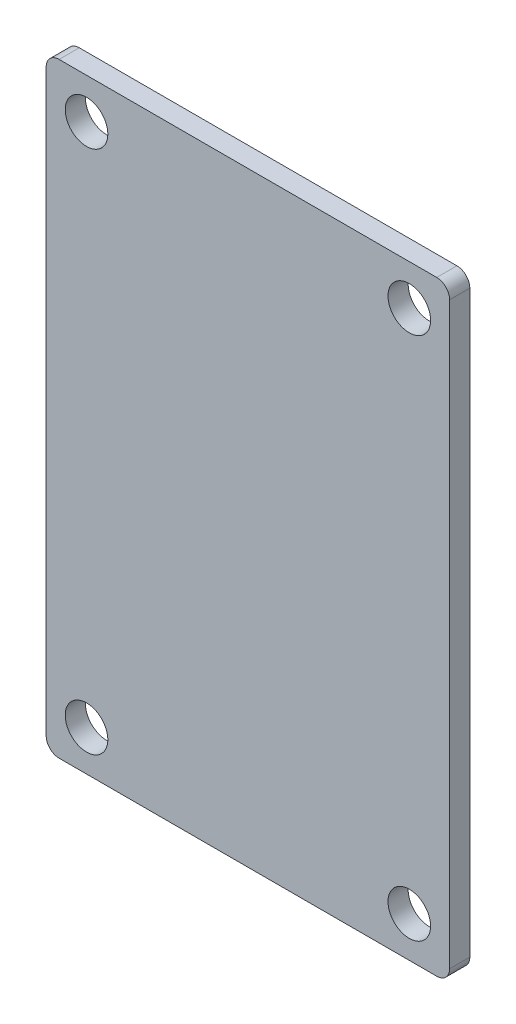
ISO-10303-21;
HEADER;
FILE_DESCRIPTION(('STEP AP214'),'2;1');
FILE_NAME('part.step','',(''),(''),'','','');
FILE_SCHEMA(('AUTOMOTIVE_DESIGN { 1 0 10303 214 1 1 1 1 }'));
ENDSEC;
DATA;
#1=APPLICATION_CONTEXT('core data for automotive mechanical design processes');
#2=APPLICATION_PROTOCOL_DEFINITION('international standard','automotive_design',2000,#1);
#3=PRODUCT_CONTEXT('',#1,'mechanical');
#4=PRODUCT('Part','Part','',(#3));
#5=PRODUCT_RELATED_PRODUCT_CATEGORY('part','',(#4));
#6=PRODUCT_DEFINITION_FORMATION('','',#4);
#7=PRODUCT_DEFINITION_CONTEXT('part definition',#1,'design');
#8=PRODUCT_DEFINITION('design','',#6,#7);
#9=PRODUCT_DEFINITION_SHAPE('','',#8);
#10=(LENGTH_UNIT() NAMED_UNIT(*) SI_UNIT(.MILLI.,.METRE.));
#11=(NAMED_UNIT(*) PLANE_ANGLE_UNIT() SI_UNIT($,.RADIAN.));
#12=(NAMED_UNIT(*) SI_UNIT($,.STERADIAN.) SOLID_ANGLE_UNIT());
#13=UNCERTAINTY_MEASURE_WITH_UNIT(LENGTH_MEASURE(1.E-05),#10,'distance_accuracy_value','');
#14=(GEOMETRIC_REPRESENTATION_CONTEXT(3) GLOBAL_UNCERTAINTY_ASSIGNED_CONTEXT((#13)) GLOBAL_UNIT_ASSIGNED_CONTEXT((#10,
#11,#12)) REPRESENTATION_CONTEXT('',''));
#15=CARTESIAN_POINT('',(0.,0.,0.));
#16=DIRECTION('',(0.,0.,1.));
#17=DIRECTION('',(1.,0.,0.));
#18=AXIS2_PLACEMENT_3D('',#15,#16,#17);
#19=CARTESIAN_POINT('',(0.,0.,3.175));
#20=DIRECTION('',(0.,0.,-1.));
#21=DIRECTION('',(-1.,0.,0.));
#22=AXIS2_PLACEMENT_3D('',#19,#20,#21);
#23=PLANE('',#22);
#24=CARTESIAN_POINT('',(-29.718,45.593,3.175));
#25=DIRECTION('',(0.,0.,-1.));
#26=DIRECTION('',(-1.,0.,0.));
#27=AXIS2_PLACEMENT_3D('',#24,#25,#26);
#28=CIRCLE('',#27,2.032);
#29=CARTESIAN_POINT('',(-31.75,45.593,3.175));
#30=VERTEX_POINT('',#29);
#31=CARTESIAN_POINT('',(-29.718,47.625,3.175));
#32=VERTEX_POINT('',#31);
#33=EDGE_CURVE('E80',#30,#32,#28,.T.);
#34=ORIENTED_EDGE('',*,*,#33,.F.);
#35=DIRECTION('',(0.,1.,0.));
#36=VECTOR('',#35,1.);
#37=CARTESIAN_POINT('',(-31.75,-47.625,3.175));
#38=LINE('',#37,#36);
#39=CARTESIAN_POINT('',(-31.75,-45.593,3.175));
#40=VERTEX_POINT('',#39);
#41=EDGE_CURVE('E98',#30,#40,#38,.F.);
#42=ORIENTED_EDGE('',*,*,#41,.T.);
#43=CARTESIAN_POINT('',(-29.718,-45.593,3.175));
#44=DIRECTION('',(0.,0.,-1.));
#45=DIRECTION('',(-1.,0.,0.));
#46=AXIS2_PLACEMENT_3D('',#43,#44,#45);
#47=CIRCLE('',#46,2.032);
#48=CARTESIAN_POINT('',(-29.718,-47.625,3.175));
#49=VERTEX_POINT('',#48);
#50=EDGE_CURVE('E142',#49,#40,#47,.T.);
#51=ORIENTED_EDGE('',*,*,#50,.F.);
#52=DIRECTION('',(1.,0.,0.));
#53=VECTOR('',#52,1.);
#54=CARTESIAN_POINT('',(-31.75,-47.625,3.175));
#55=LINE('',#54,#53);
#56=CARTESIAN_POINT('',(29.718,-47.625,3.175));
#57=VERTEX_POINT('',#56);
#58=EDGE_CURVE('E111',#49,#57,#55,.T.);
#59=ORIENTED_EDGE('',*,*,#58,.T.);
#60=CARTESIAN_POINT('',(29.718,-45.593,3.175));
#61=DIRECTION('',(0.,0.,-1.));
#62=DIRECTION('',(-1.,0.,0.));
#63=AXIS2_PLACEMENT_3D('',#60,#61,#62);
#64=CIRCLE('',#63,2.032);
#65=CARTESIAN_POINT('',(31.75,-45.593,3.175));
#66=VERTEX_POINT('',#65);
#67=EDGE_CURVE('E146',#66,#57,#64,.T.);
#68=ORIENTED_EDGE('',*,*,#67,.F.);
#69=DIRECTION('',(0.,1.,0.));
#70=VECTOR('',#69,1.);
#71=CARTESIAN_POINT('',(31.75,-47.625,3.175));
#72=LINE('',#71,#70);
#73=CARTESIAN_POINT('',(31.75,45.593,3.175));
#74=VERTEX_POINT('',#73);
#75=EDGE_CURVE('E117',#66,#74,#72,.T.);
#76=ORIENTED_EDGE('',*,*,#75,.T.);
#77=CARTESIAN_POINT('',(29.718,45.593,3.175));
#78=DIRECTION('',(0.,0.,-1.));
#79=DIRECTION('',(-1.,0.,0.));
#80=AXIS2_PLACEMENT_3D('',#77,#78,#79);
#81=CIRCLE('',#80,2.032);
#82=CARTESIAN_POINT('',(29.718,47.625,3.175));
#83=VERTEX_POINT('',#82);
#84=EDGE_CURVE('E86',#83,#74,#81,.T.);
#85=ORIENTED_EDGE('',*,*,#84,.F.);
#86=DIRECTION('',(1.,0.,0.));
#87=VECTOR('',#86,1.);
#88=CARTESIAN_POINT('',(-31.75,47.625,3.175));
#89=LINE('',#88,#87);
#90=EDGE_CURVE('E83',#83,#32,#89,.F.);
#91=ORIENTED_EDGE('',*,*,#90,.T.);
#92=EDGE_LOOP('',(#34,#42,#51,#59,#68,#76,#85,#91));
#93=FACE_BOUND('',#92,.T.);
#94=CARTESIAN_POINT('',(-25.4,41.275,3.175));
#95=DIRECTION('',(0.,0.,1.));
#96=DIRECTION('',(1.,0.,0.));
#97=AXIS2_PLACEMENT_3D('',#94,#95,#96);
#98=CIRCLE('',#97,3.3528);
#99=CARTESIAN_POINT('',(-22.0472,41.275,3.175));
#100=VERTEX_POINT('',#99);
#101=EDGE_CURVE('E116',#100,#100,#98,.F.);
#102=ORIENTED_EDGE('',*,*,#101,.T.);
#103=EDGE_LOOP('',(#102));
#104=FACE_BOUND('',#103,.T.);
#105=CARTESIAN_POINT('',(-25.4,-41.275,3.175));
#106=DIRECTION('',(0.,0.,1.));
#107=DIRECTION('',(1.,0.,0.));
#108=AXIS2_PLACEMENT_3D('',#105,#106,#107);
#109=CIRCLE('',#108,3.3528);
#110=CARTESIAN_POINT('',(-22.0472,-41.275,3.175));
#111=VERTEX_POINT('',#110);
#112=EDGE_CURVE('E151',#111,#111,#109,.F.);
#113=ORIENTED_EDGE('',*,*,#112,.T.);
#114=EDGE_LOOP('',(#113));
#115=FACE_BOUND('',#114,.T.);
#116=CARTESIAN_POINT('',(25.4,41.275,3.175));
#117=DIRECTION('',(0.,0.,1.));
#118=DIRECTION('',(1.,0.,0.));
#119=AXIS2_PLACEMENT_3D('',#116,#117,#118);
#120=CIRCLE('',#119,3.3528);
#121=CARTESIAN_POINT('',(28.7528,41.275,3.175));
#122=VERTEX_POINT('',#121);
#123=EDGE_CURVE('E153',#122,#122,#120,.F.);
#124=ORIENTED_EDGE('',*,*,#123,.T.);
#125=EDGE_LOOP('',(#124));
#126=FACE_BOUND('',#125,.T.);
#127=CARTESIAN_POINT('',(25.4,-41.275,3.175));
#128=DIRECTION('',(0.,0.,1.));
#129=DIRECTION('',(1.,0.,0.));
#130=AXIS2_PLACEMENT_3D('',#127,#128,#129);
#131=CIRCLE('',#130,3.3528);
#132=CARTESIAN_POINT('',(28.7528,-41.275,3.175));
#133=VERTEX_POINT('',#132);
#134=EDGE_CURVE('E20',#133,#133,#131,.F.);
#135=ORIENTED_EDGE('',*,*,#134,.T.);
#136=EDGE_LOOP('',(#135));
#137=FACE_BOUND('',#136,.T.);
#138=ADVANCED_FACE('F17',(#93,#104,#115,#126,#137),#23,.F.);
#139=CARTESIAN_POINT('',(25.4,-41.275,0.));
#140=DIRECTION('',(0.,0.,1.));
#141=DIRECTION('',(1.,0.,0.));
#142=AXIS2_PLACEMENT_3D('',#139,#140,#141);
#143=CYLINDRICAL_SURFACE('',#142,3.3528);
#144=ORIENTED_EDGE('',*,*,#134,.F.);
#145=EDGE_LOOP('',(#144));
#146=FACE_BOUND('',#145,.T.);
#147=CARTESIAN_POINT('',(25.4,-41.275,0.));
#148=DIRECTION('',(0.,0.,1.));
#149=DIRECTION('',(1.,0.,0.));
#150=AXIS2_PLACEMENT_3D('',#147,#148,#149);
#151=CIRCLE('',#150,3.3528);
#152=CARTESIAN_POINT('',(28.7528,-41.275,0.));
#153=VERTEX_POINT('',#152);
#154=EDGE_CURVE('E139',#153,#153,#151,.T.);
#155=ORIENTED_EDGE('',*,*,#154,.F.);
#156=EDGE_LOOP('',(#155));
#157=FACE_BOUND('',#156,.T.);
#158=ADVANCED_FACE('F161',(#146,#157),#143,.F.);
#159=CARTESIAN_POINT('',(25.4,41.275,0.));
#160=DIRECTION('',(0.,0.,1.));
#161=DIRECTION('',(1.,0.,0.));
#162=AXIS2_PLACEMENT_3D('',#159,#160,#161);
#163=CYLINDRICAL_SURFACE('',#162,3.3528);
#164=ORIENTED_EDGE('',*,*,#123,.F.);
#165=EDGE_LOOP('',(#164));
#166=FACE_BOUND('',#165,.T.);
#167=CARTESIAN_POINT('',(25.4,41.275,0.));
#168=DIRECTION('',(0.,0.,1.));
#169=DIRECTION('',(1.,0.,0.));
#170=AXIS2_PLACEMENT_3D('',#167,#168,#169);
#171=CIRCLE('',#170,3.3528);
#172=CARTESIAN_POINT('',(28.7528,41.275,0.));
#173=VERTEX_POINT('',#172);
#174=EDGE_CURVE('E136',#173,#173,#171,.T.);
#175=ORIENTED_EDGE('',*,*,#174,.F.);
#176=EDGE_LOOP('',(#175));
#177=FACE_BOUND('',#176,.T.);
#178=ADVANCED_FACE('F164',(#166,#177),#163,.F.);
#179=CARTESIAN_POINT('',(-25.4,-41.275,0.));
#180=DIRECTION('',(0.,0.,1.));
#181=DIRECTION('',(1.,0.,0.));
#182=AXIS2_PLACEMENT_3D('',#179,#180,#181);
#183=CYLINDRICAL_SURFACE('',#182,3.3528);
#184=ORIENTED_EDGE('',*,*,#112,.F.);
#185=EDGE_LOOP('',(#184));
#186=FACE_BOUND('',#185,.T.);
#187=CARTESIAN_POINT('',(-25.4,-41.275,0.));
#188=DIRECTION('',(0.,0.,1.));
#189=DIRECTION('',(1.,0.,0.));
#190=AXIS2_PLACEMENT_3D('',#187,#188,#189);
#191=CIRCLE('',#190,3.3528);
#192=CARTESIAN_POINT('',(-22.0472,-41.275,0.));
#193=VERTEX_POINT('',#192);
#194=EDGE_CURVE('E133',#193,#193,#191,.T.);
#195=ORIENTED_EDGE('',*,*,#194,.F.);
#196=EDGE_LOOP('',(#195));
#197=FACE_BOUND('',#196,.T.);
#198=ADVANCED_FACE('F207',(#186,#197),#183,.F.);
#199=CARTESIAN_POINT('',(-25.4,41.275,0.));
#200=DIRECTION('',(0.,0.,1.));
#201=DIRECTION('',(1.,0.,0.));
#202=AXIS2_PLACEMENT_3D('',#199,#200,#201);
#203=CYLINDRICAL_SURFACE('',#202,3.3528);
#204=ORIENTED_EDGE('',*,*,#101,.F.);
#205=EDGE_LOOP('',(#204));
#206=FACE_BOUND('',#205,.T.);
#207=CARTESIAN_POINT('',(-25.4,41.275,0.));
#208=DIRECTION('',(0.,0.,1.));
#209=DIRECTION('',(1.,0.,0.));
#210=AXIS2_PLACEMENT_3D('',#207,#208,#209);
#211=CIRCLE('',#210,3.3528);
#212=CARTESIAN_POINT('',(-22.0472,41.275,0.));
#213=VERTEX_POINT('',#212);
#214=EDGE_CURVE('E130',#213,#213,#211,.T.);
#215=ORIENTED_EDGE('',*,*,#214,.F.);
#216=EDGE_LOOP('',(#215));
#217=FACE_BOUND('',#216,.T.);
#218=ADVANCED_FACE('F203',(#206,#217),#203,.F.);
#219=CARTESIAN_POINT('',(-31.75,-47.625,3.175));
#220=DIRECTION('',(1.,0.,0.));
#221=DIRECTION('',(0.,0.,-1.));
#222=AXIS2_PLACEMENT_3D('',#219,#220,#221);
#223=PLANE('',#222);
#224=DIRECTION('',(0.,0.,-1.));
#225=VECTOR('',#224,1.);
#226=CARTESIAN_POINT('',(-31.75,45.593,3.175));
#227=LINE('',#226,#225);
#228=CARTESIAN_POINT('',(-31.75,45.593,0.));
#229=VERTEX_POINT('',#228);
#230=EDGE_CURVE('E91',#229,#30,#227,.F.);
#231=ORIENTED_EDGE('',*,*,#230,.F.);
#232=DIRECTION('',(0.,1.,0.));
#233=VECTOR('',#232,1.);
#234=CARTESIAN_POINT('',(-31.75,0.,0.));
#235=LINE('',#234,#233);
#236=CARTESIAN_POINT('',(-31.75,-45.593,0.));
#237=VERTEX_POINT('',#236);
#238=EDGE_CURVE('E129',#237,#229,#235,.T.);
#239=ORIENTED_EDGE('',*,*,#238,.F.);
#240=DIRECTION('',(0.,0.,-1.));
#241=VECTOR('',#240,1.);
#242=CARTESIAN_POINT('',(-31.75,-45.593,3.175));
#243=LINE('',#242,#241);
#244=EDGE_CURVE('E145',#40,#237,#243,.T.);
#245=ORIENTED_EDGE('',*,*,#244,.F.);
#246=ORIENTED_EDGE('',*,*,#41,.F.);
#247=EDGE_LOOP('',(#231,#239,#245,#246));
#248=FACE_BOUND('',#247,.T.);
#249=ADVANCED_FACE('F200',(#248),#223,.F.);
#250=CARTESIAN_POINT('',(-29.718,45.593,3.175));
#251=DIRECTION('',(0.,0.,-1.));
#252=DIRECTION('',(-1.,0.,0.));
#253=AXIS2_PLACEMENT_3D('',#250,#251,#252);
#254=CYLINDRICAL_SURFACE('',#253,2.032);
#255=CARTESIAN_POINT('',(-29.718,45.593,0.));
#256=DIRECTION('',(0.,0.,-1.));
#257=DIRECTION('',(-1.,0.,0.));
#258=AXIS2_PLACEMENT_3D('',#255,#256,#257);
#259=CIRCLE('',#258,2.032);
#260=CARTESIAN_POINT('',(-29.718,47.625,0.));
#261=VERTEX_POINT('',#260);
#262=EDGE_CURVE('E127',#229,#261,#259,.T.);
#263=ORIENTED_EDGE('',*,*,#262,.F.);
#264=ORIENTED_EDGE('',*,*,#230,.T.);
#265=ORIENTED_EDGE('',*,*,#33,.T.);
#266=DIRECTION('',(0.,0.,-1.));
#267=VECTOR('',#266,1.);
#268=CARTESIAN_POINT('',(-29.718,47.625,3.175));
#269=LINE('',#268,#267);
#270=EDGE_CURVE('E90',#32,#261,#269,.T.);
#271=ORIENTED_EDGE('',*,*,#270,.T.);
#272=EDGE_LOOP('',(#263,#264,#265,#271));
#273=FACE_BOUND('',#272,.T.);
#274=ADVANCED_FACE('F96',(#273),#254,.T.);
#275=CARTESIAN_POINT('',(-31.75,47.625,3.175));
#276=DIRECTION('',(0.,-1.,0.));
#277=DIRECTION('',(0.,0.,-1.));
#278=AXIS2_PLACEMENT_3D('',#275,#276,#277);
#279=PLANE('',#278);
#280=ORIENTED_EDGE('',*,*,#270,.F.);
#281=ORIENTED_EDGE('',*,*,#90,.F.);
#282=DIRECTION('',(0.,0.,-1.));
#283=VECTOR('',#282,1.);
#284=CARTESIAN_POINT('',(29.718,47.625,3.175));
#285=LINE('',#284,#283);
#286=CARTESIAN_POINT('',(29.718,47.625,0.));
#287=VERTEX_POINT('',#286);
#288=EDGE_CURVE('E105',#287,#83,#285,.F.);
#289=ORIENTED_EDGE('',*,*,#288,.F.);
#290=DIRECTION('',(-1.,0.,0.));
#291=VECTOR('',#290,1.);
#292=CARTESIAN_POINT('',(0.,47.625,0.));
#293=LINE('',#292,#291);
#294=EDGE_CURVE('E102',#261,#287,#293,.F.);
#295=ORIENTED_EDGE('',*,*,#294,.F.);
#296=EDGE_LOOP('',(#280,#281,#289,#295));
#297=FACE_BOUND('',#296,.T.);
#298=ADVANCED_FACE('F100',(#297),#279,.F.);
#299=CARTESIAN_POINT('',(29.718,45.593,3.175));
#300=DIRECTION('',(0.,0.,-1.));
#301=DIRECTION('',(-1.,0.,0.));
#302=AXIS2_PLACEMENT_3D('',#299,#300,#301);
#303=CYLINDRICAL_SURFACE('',#302,2.032);
#304=CARTESIAN_POINT('',(29.718,45.593,0.));
#305=DIRECTION('',(0.,0.,-1.));
#306=DIRECTION('',(-1.,0.,0.));
#307=AXIS2_PLACEMENT_3D('',#304,#305,#306);
#308=CIRCLE('',#307,2.032);
#309=CARTESIAN_POINT('',(31.75,45.593,0.));
#310=VERTEX_POINT('',#309);
#311=EDGE_CURVE('E124',#287,#310,#308,.T.);
#312=ORIENTED_EDGE('',*,*,#311,.F.);
#313=ORIENTED_EDGE('',*,*,#288,.T.);
#314=ORIENTED_EDGE('',*,*,#84,.T.);
#315=DIRECTION('',(0.,0.,1.));
#316=VECTOR('',#315,1.);
#317=CARTESIAN_POINT('',(31.75,45.593,3.175));
#318=LINE('',#317,#316);
#319=EDGE_CURVE('E118',#74,#310,#318,.F.);
#320=ORIENTED_EDGE('',*,*,#319,.T.);
#321=EDGE_LOOP('',(#312,#313,#314,#320));
#322=FACE_BOUND('',#321,.T.);
#323=ADVANCED_FACE('F191',(#322),#303,.T.);
#324=CARTESIAN_POINT('',(31.75,-47.625,3.175));
#325=DIRECTION('',(-1.,0.,0.));
#326=DIRECTION('',(0.,0.,1.));
#327=AXIS2_PLACEMENT_3D('',#324,#325,#326);
#328=PLANE('',#327);
#329=ORIENTED_EDGE('',*,*,#319,.F.);
#330=ORIENTED_EDGE('',*,*,#75,.F.);
#331=DIRECTION('',(0.,0.,-1.));
#332=VECTOR('',#331,1.);
#333=CARTESIAN_POINT('',(31.75,-45.593,3.175));
#334=LINE('',#333,#332);
#335=CARTESIAN_POINT('',(31.75,-45.593,0.));
#336=VERTEX_POINT('',#335);
#337=EDGE_CURVE('E114',#336,#66,#334,.F.);
#338=ORIENTED_EDGE('',*,*,#337,.F.);
#339=DIRECTION('',(0.,1.,0.));
#340=VECTOR('',#339,1.);
#341=CARTESIAN_POINT('',(31.75,0.,0.));
#342=LINE('',#341,#340);
#343=EDGE_CURVE('E123',#310,#336,#342,.F.);
#344=ORIENTED_EDGE('',*,*,#343,.F.);
#345=EDGE_LOOP('',(#329,#330,#338,#344));
#346=FACE_BOUND('',#345,.T.);
#347=ADVANCED_FACE('F187',(#346),#328,.F.);
#348=CARTESIAN_POINT('',(29.718,-45.593,3.175));
#349=DIRECTION('',(0.,0.,-1.));
#350=DIRECTION('',(-1.,0.,0.));
#351=AXIS2_PLACEMENT_3D('',#348,#349,#350);
#352=CYLINDRICAL_SURFACE('',#351,2.032);
#353=CARTESIAN_POINT('',(29.718,-45.593,0.));
#354=DIRECTION('',(0.,0.,-1.));
#355=DIRECTION('',(-1.,0.,0.));
#356=AXIS2_PLACEMENT_3D('',#353,#354,#355);
#357=CIRCLE('',#356,2.032);
#358=CARTESIAN_POINT('',(29.718,-47.625,0.));
#359=VERTEX_POINT('',#358);
#360=EDGE_CURVE('E120',#336,#359,#357,.T.);
#361=ORIENTED_EDGE('',*,*,#360,.F.);
#362=ORIENTED_EDGE('',*,*,#337,.T.);
#363=ORIENTED_EDGE('',*,*,#67,.T.);
#364=DIRECTION('',(0.,0.,1.));
#365=VECTOR('',#364,1.);
#366=CARTESIAN_POINT('',(29.718,-47.625,3.175));
#367=LINE('',#366,#365);
#368=EDGE_CURVE('E113',#57,#359,#367,.F.);
#369=ORIENTED_EDGE('',*,*,#368,.T.);
#370=EDGE_LOOP('',(#361,#362,#363,#369));
#371=FACE_BOUND('',#370,.T.);
#372=ADVANCED_FACE('F184',(#371),#352,.T.);
#373=CARTESIAN_POINT('',(-31.75,-47.625,3.175));
#374=DIRECTION('',(0.,1.,0.));
#375=DIRECTION('',(0.,0.,1.));
#376=AXIS2_PLACEMENT_3D('',#373,#374,#375);
#377=PLANE('',#376);
#378=ORIENTED_EDGE('',*,*,#368,.F.);
#379=ORIENTED_EDGE('',*,*,#58,.F.);
#380=DIRECTION('',(0.,0.,-1.));
#381=VECTOR('',#380,1.);
#382=CARTESIAN_POINT('',(-29.718,-47.625,3.175));
#383=LINE('',#382,#381);
#384=CARTESIAN_POINT('',(-29.718,-47.625,0.));
#385=VERTEX_POINT('',#384);
#386=EDGE_CURVE('E35',#385,#49,#383,.F.);
#387=ORIENTED_EDGE('',*,*,#386,.F.);
#388=DIRECTION('',(-1.,0.,0.));
#389=VECTOR('',#388,1.);
#390=CARTESIAN_POINT('',(0.,-47.625,0.));
#391=LINE('',#390,#389);
#392=EDGE_CURVE('E26',#359,#385,#391,.T.);
#393=ORIENTED_EDGE('',*,*,#392,.F.);
#394=EDGE_LOOP('',(#378,#379,#387,#393));
#395=FACE_BOUND('',#394,.T.);
#396=ADVANCED_FACE('F176',(#395),#377,.F.);
#397=CARTESIAN_POINT('',(-29.718,-45.593,3.175));
#398=DIRECTION('',(0.,0.,-1.));
#399=DIRECTION('',(-1.,0.,0.));
#400=AXIS2_PLACEMENT_3D('',#397,#398,#399);
#401=CYLINDRICAL_SURFACE('',#400,2.032);
#402=CARTESIAN_POINT('',(-29.718,-45.593,0.));
#403=DIRECTION('',(0.,0.,-1.));
#404=DIRECTION('',(-1.,0.,0.));
#405=AXIS2_PLACEMENT_3D('',#402,#403,#404);
#406=CIRCLE('',#405,2.032);
#407=EDGE_CURVE('E11',#385,#237,#406,.T.);
#408=ORIENTED_EDGE('',*,*,#407,.F.);
#409=ORIENTED_EDGE('',*,*,#386,.T.);
#410=ORIENTED_EDGE('',*,*,#50,.T.);
#411=ORIENTED_EDGE('',*,*,#244,.T.);
#412=EDGE_LOOP('',(#408,#409,#410,#411));
#413=FACE_BOUND('',#412,.T.);
#414=ADVANCED_FACE('F169',(#413),#401,.T.);
#415=CARTESIAN_POINT('',(0.,0.,0.));
#416=DIRECTION('',(0.,0.,-1.));
#417=DIRECTION('',(-1.,0.,0.));
#418=AXIS2_PLACEMENT_3D('',#415,#416,#417);
#419=PLANE('',#418);
#420=ORIENTED_EDGE('',*,*,#392,.T.);
#421=ORIENTED_EDGE('',*,*,#407,.T.);
#422=ORIENTED_EDGE('',*,*,#238,.T.);
#423=ORIENTED_EDGE('',*,*,#262,.T.);
#424=ORIENTED_EDGE('',*,*,#294,.T.);
#425=ORIENTED_EDGE('',*,*,#311,.T.);
#426=ORIENTED_EDGE('',*,*,#343,.T.);
#427=ORIENTED_EDGE('',*,*,#360,.T.);
#428=EDGE_LOOP('',(#420,#421,#422,#423,#424,#425,#426,#427));
#429=FACE_BOUND('',#428,.T.);
#430=ORIENTED_EDGE('',*,*,#214,.T.);
#431=EDGE_LOOP('',(#430));
#432=FACE_BOUND('',#431,.T.);
#433=ORIENTED_EDGE('',*,*,#194,.T.);
#434=EDGE_LOOP('',(#433));
#435=FACE_BOUND('',#434,.T.);
#436=ORIENTED_EDGE('',*,*,#174,.T.);
#437=EDGE_LOOP('',(#436));
#438=FACE_BOUND('',#437,.T.);
#439=ORIENTED_EDGE('',*,*,#154,.T.);
#440=EDGE_LOOP('',(#439));
#441=FACE_BOUND('',#440,.T.);
#442=ADVANCED_FACE('F167',(#429,#432,#435,#438,#441),#419,.T.);
#443=CLOSED_SHELL('',(#138,#158,#178,#198,#218,#249,#274,#298,#323,#347,#372,#396,#414,#442));
#444=MANIFOLD_SOLID_BREP('B1',#443);
#445=ADVANCED_BREP_SHAPE_REPRESENTATION('',(#18,#444),#14);
#446=SHAPE_DEFINITION_REPRESENTATION(#9,#445);
ENDSEC;
END-ISO-10303-21;
